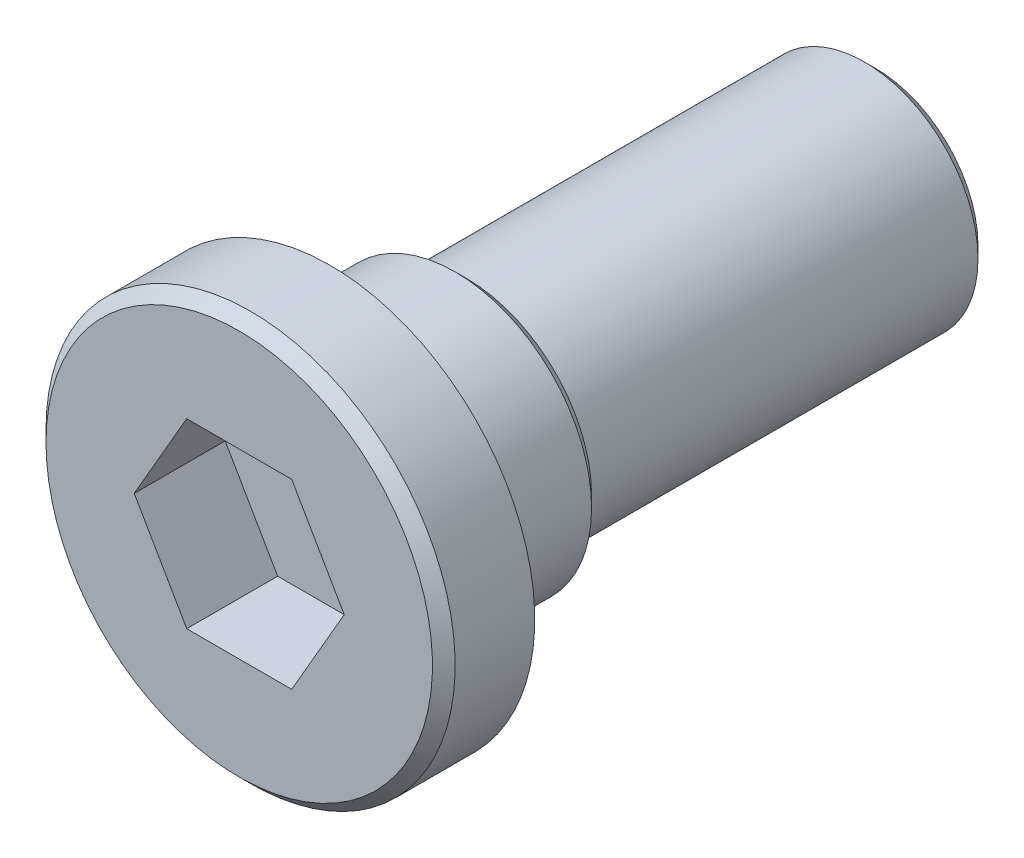
ISO-10303-21;
HEADER;
FILE_DESCRIPTION(('STEP AP214'),'2;1');
FILE_NAME('part.step','',(''),(''),'','','');
FILE_SCHEMA(('AUTOMOTIVE_DESIGN { 1 0 10303 214 1 1 1 1 }'));
ENDSEC;
DATA;
#1=APPLICATION_CONTEXT('core data for automotive mechanical design processes');
#2=APPLICATION_PROTOCOL_DEFINITION('international standard','automotive_design',2000,#1);
#3=PRODUCT_CONTEXT('',#1,'mechanical');
#4=PRODUCT('Part','Part','',(#3));
#5=PRODUCT_RELATED_PRODUCT_CATEGORY('part','',(#4));
#6=PRODUCT_DEFINITION_FORMATION('','',#4);
#7=PRODUCT_DEFINITION_CONTEXT('part definition',#1,'design');
#8=PRODUCT_DEFINITION('design','',#6,#7);
#9=PRODUCT_DEFINITION_SHAPE('','',#8);
#10=(LENGTH_UNIT() NAMED_UNIT(*) SI_UNIT(.MILLI.,.METRE.));
#11=(NAMED_UNIT(*) PLANE_ANGLE_UNIT() SI_UNIT($,.RADIAN.));
#12=(NAMED_UNIT(*) SI_UNIT($,.STERADIAN.) SOLID_ANGLE_UNIT());
#13=UNCERTAINTY_MEASURE_WITH_UNIT(LENGTH_MEASURE(1.E-05),#10,'distance_accuracy_value','');
#14=(GEOMETRIC_REPRESENTATION_CONTEXT(3) GLOBAL_UNCERTAINTY_ASSIGNED_CONTEXT((#13)) GLOBAL_UNIT_ASSIGNED_CONTEXT((#10,
#11,#12)) REPRESENTATION_CONTEXT('',''));
#15=CARTESIAN_POINT('',(0.,0.,0.));
#16=DIRECTION('',(0.,0.,1.));
#17=DIRECTION('',(1.,0.,0.));
#18=AXIS2_PLACEMENT_3D('',#15,#16,#17);
#19=CARTESIAN_POINT('',(2.25,0.,0.));
#20=DIRECTION('',(0.,0.,-1.));
#21=DIRECTION('',(-1.,0.,0.));
#22=AXIS2_PLACEMENT_3D('',#19,#20,#21);
#23=PLANE('',#22);
#24=CARTESIAN_POINT('',(0.,0.,0.));
#25=DIRECTION('',(0.,0.,-1.));
#26=DIRECTION('',(-1.,0.,0.));
#27=AXIS2_PLACEMENT_3D('',#24,#25,#26);
#28=CIRCLE('',#27,2.125);
#29=CARTESIAN_POINT('',(-2.125,0.,0.));
#30=VERTEX_POINT('',#29);
#31=EDGE_CURVE('E11',#30,#30,#28,.F.);
#32=ORIENTED_EDGE('',*,*,#31,.T.);
#33=EDGE_LOOP('',(#32));
#34=FACE_BOUND('',#33,.T.);
#35=DIRECTION('',(-0.5,0.866025403784438,0.));
#36=VECTOR('',#35,1.);
#37=CARTESIAN_POINT('',(1.15470053837925,0.,0.));
#38=LINE('',#37,#36);
#39=CARTESIAN_POINT('',(1.15470053837925,0.,0.));
#40=VERTEX_POINT('',#39);
#41=CARTESIAN_POINT('',(0.577350269189625,1.,0.));
#42=VERTEX_POINT('',#41);
#43=EDGE_CURVE('E124',#40,#42,#38,.T.);
#44=ORIENTED_EDGE('',*,*,#43,.F.);
#45=DIRECTION('',(0.5,0.866025403784438,0.));
#46=VECTOR('',#45,1.);
#47=CARTESIAN_POINT('',(0.577350269189626,-1.,0.));
#48=LINE('',#47,#46);
#49=CARTESIAN_POINT('',(0.577350269189626,-1.,0.));
#50=VERTEX_POINT('',#49);
#51=EDGE_CURVE('E50',#50,#40,#48,.T.);
#52=ORIENTED_EDGE('',*,*,#51,.F.);
#53=DIRECTION('',(1.,0.,0.));
#54=VECTOR('',#53,1.);
#55=CARTESIAN_POINT('',(-0.577350269189626,-1.,0.));
#56=LINE('',#55,#54);
#57=CARTESIAN_POINT('',(-0.577350269189626,-1.,0.));
#58=VERTEX_POINT('',#57);
#59=EDGE_CURVE('E133',#58,#50,#56,.T.);
#60=ORIENTED_EDGE('',*,*,#59,.F.);
#61=DIRECTION('',(0.5,-0.866025403784438,0.));
#62=VECTOR('',#61,1.);
#63=CARTESIAN_POINT('',(-1.15470053837925,0.,0.));
#64=LINE('',#63,#62);
#65=CARTESIAN_POINT('',(-1.15470053837925,0.,0.));
#66=VERTEX_POINT('',#65);
#67=EDGE_CURVE('E131',#66,#58,#64,.T.);
#68=ORIENTED_EDGE('',*,*,#67,.F.);
#69=DIRECTION('',(-0.5,-0.866025403784439,0.));
#70=VECTOR('',#69,1.);
#71=CARTESIAN_POINT('',(-0.577350269189626,1.,0.));
#72=LINE('',#71,#70);
#73=CARTESIAN_POINT('',(-0.577350269189626,1.,0.));
#74=VERTEX_POINT('',#73);
#75=EDGE_CURVE('E98',#74,#66,#72,.T.);
#76=ORIENTED_EDGE('',*,*,#75,.F.);
#77=DIRECTION('',(-1.,0.,0.));
#78=VECTOR('',#77,1.);
#79=CARTESIAN_POINT('',(0.577350269189625,1.,0.));
#80=LINE('',#79,#78);
#81=EDGE_CURVE('E127',#42,#74,#80,.T.);
#82=ORIENTED_EDGE('',*,*,#81,.F.);
#83=EDGE_LOOP('',(#44,#52,#60,#68,#76,#82));
#84=FACE_BOUND('',#83,.T.);
#85=ADVANCED_FACE('F35',(#34,#84),#23,.F.);
#86=CARTESIAN_POINT('',(0.,0.,-7.));
#87=DIRECTION('',(0.,0.,1.));
#88=DIRECTION('',(1.,0.,0.));
#89=AXIS2_PLACEMENT_3D('',#86,#87,#88);
#90=PLANE('',#89);
#91=CARTESIAN_POINT('',(0.,0.,-7.));
#92=DIRECTION('',(0.,0.,1.));
#93=DIRECTION('',(1.,0.,0.));
#94=AXIS2_PLACEMENT_3D('',#91,#92,#93);
#95=CIRCLE('',#94,1.125);
#96=CARTESIAN_POINT('',(1.125,0.,-7.));
#97=VERTEX_POINT('',#96);
#98=EDGE_CURVE('E157',#97,#97,#95,.F.);
#99=ORIENTED_EDGE('',*,*,#98,.T.);
#100=EDGE_LOOP('',(#99));
#101=FACE_BOUND('',#100,.T.);
#102=ADVANCED_FACE('F178',(#101),#90,.F.);
#103=CARTESIAN_POINT('',(0.,0.,0.));
#104=DIRECTION('',(0.,0.,-1.));
#105=DIRECTION('',(-1.,0.,0.));
#106=AXIS2_PLACEMENT_3D('',#103,#104,#105);
#107=CYLINDRICAL_SURFACE('',#106,1.25);
#108=CARTESIAN_POINT('',(0.,0.,-6.875));
#109=DIRECTION('',(0.,0.,1.));
#110=DIRECTION('',(1.,0.,0.));
#111=AXIS2_PLACEMENT_3D('',#108,#109,#110);
#112=CIRCLE('',#111,1.25);
#113=CARTESIAN_POINT('',(1.25,0.,-6.875));
#114=VERTEX_POINT('',#113);
#115=EDGE_CURVE('E160',#114,#114,#112,.T.);
#116=ORIENTED_EDGE('',*,*,#115,.T.);
#117=EDGE_LOOP('',(#116));
#118=FACE_BOUND('',#117,.T.);
#119=CARTESIAN_POINT('',(0.,0.,-2.5));
#120=DIRECTION('',(0.,0.,-1.));
#121=DIRECTION('',(-1.,0.,0.));
#122=AXIS2_PLACEMENT_3D('',#119,#120,#121);
#123=CIRCLE('',#122,1.25);
#124=CARTESIAN_POINT('',(-1.25,0.,-2.5));
#125=VERTEX_POINT('',#124);
#126=EDGE_CURVE('E148',#125,#125,#123,.T.);
#127=ORIENTED_EDGE('',*,*,#126,.T.);
#128=EDGE_LOOP('',(#127));
#129=FACE_BOUND('',#128,.T.);
#130=ADVANCED_FACE('F184',(#118,#129),#107,.T.);
#131=CARTESIAN_POINT('',(1.25,0.,-2.5));
#132=DIRECTION('',(0.,0.,1.));
#133=DIRECTION('',(1.,0.,0.));
#134=AXIS2_PLACEMENT_3D('',#131,#132,#133);
#135=PLANE('',#134);
#136=CARTESIAN_POINT('',(0.,0.,-2.5));
#137=DIRECTION('',(0.,0.,1.));
#138=DIRECTION('',(1.,0.,0.));
#139=AXIS2_PLACEMENT_3D('',#136,#137,#138);
#140=CIRCLE('',#139,1.375);
#141=CARTESIAN_POINT('',(1.375,0.,-2.5));
#142=VERTEX_POINT('',#141);
#143=EDGE_CURVE('E151',#142,#142,#140,.F.);
#144=ORIENTED_EDGE('',*,*,#143,.T.);
#145=EDGE_LOOP('',(#144));
#146=FACE_BOUND('',#145,.T.);
#147=ORIENTED_EDGE('',*,*,#126,.F.);
#148=EDGE_LOOP('',(#147));
#149=FACE_BOUND('',#148,.T.);
#150=ADVANCED_FACE('F201',(#146,#149),#135,.F.);
#151=CARTESIAN_POINT('',(0.,0.,0.));
#152=DIRECTION('',(0.,0.,-1.));
#153=DIRECTION('',(-1.,0.,0.));
#154=AXIS2_PLACEMENT_3D('',#151,#152,#153);
#155=CYLINDRICAL_SURFACE('',#154,1.5);
#156=CARTESIAN_POINT('',(0.,0.,-2.375));
#157=DIRECTION('',(0.,0.,1.));
#158=DIRECTION('',(1.,0.,0.));
#159=AXIS2_PLACEMENT_3D('',#156,#157,#158);
#160=CIRCLE('',#159,1.5);
#161=CARTESIAN_POINT('',(1.5,0.,-2.375));
#162=VERTEX_POINT('',#161);
#163=EDGE_CURVE('E154',#162,#162,#160,.T.);
#164=ORIENTED_EDGE('',*,*,#163,.T.);
#165=EDGE_LOOP('',(#164));
#166=FACE_BOUND('',#165,.T.);
#167=CARTESIAN_POINT('',(0.,0.,-1.));
#168=DIRECTION('',(0.,0.,-1.));
#169=DIRECTION('',(-1.,0.,0.));
#170=AXIS2_PLACEMENT_3D('',#167,#168,#169);
#171=CIRCLE('',#170,1.5);
#172=CARTESIAN_POINT('',(-1.5,0.,-1.));
#173=VERTEX_POINT('',#172);
#174=EDGE_CURVE('E145',#173,#173,#171,.T.);
#175=ORIENTED_EDGE('',*,*,#174,.T.);
#176=EDGE_LOOP('',(#175));
#177=FACE_BOUND('',#176,.T.);
#178=ADVANCED_FACE('F204',(#166,#177),#155,.T.);
#179=CARTESIAN_POINT('',(1.5,0.,-1.));
#180=DIRECTION('',(0.,0.,1.));
#181=DIRECTION('',(1.,0.,0.));
#182=AXIS2_PLACEMENT_3D('',#179,#180,#181);
#183=PLANE('',#182);
#184=ORIENTED_EDGE('',*,*,#174,.F.);
#185=EDGE_LOOP('',(#184));
#186=FACE_BOUND('',#185,.T.);
#187=CARTESIAN_POINT('',(0.,0.,-1.));
#188=DIRECTION('',(0.,0.,-1.));
#189=DIRECTION('',(-1.,0.,0.));
#190=AXIS2_PLACEMENT_3D('',#187,#188,#189);
#191=CIRCLE('',#190,2.25);
#192=CARTESIAN_POINT('',(-2.25,0.,-1.));
#193=VERTEX_POINT('',#192);
#194=EDGE_CURVE('E137',#193,#193,#191,.T.);
#195=ORIENTED_EDGE('',*,*,#194,.T.);
#196=EDGE_LOOP('',(#195));
#197=FACE_BOUND('',#196,.T.);
#198=ADVANCED_FACE('F215',(#186,#197),#183,.F.);
#199=CARTESIAN_POINT('',(0.,0.,0.));
#200=DIRECTION('',(0.,0.,-1.));
#201=DIRECTION('',(-1.,0.,0.));
#202=AXIS2_PLACEMENT_3D('',#199,#200,#201);
#203=CYLINDRICAL_SURFACE('',#202,2.25);
#204=CARTESIAN_POINT('',(0.,0.,-0.124999999999999));
#205=DIRECTION('',(0.,0.,-1.));
#206=DIRECTION('',(-1.,0.,0.));
#207=AXIS2_PLACEMENT_3D('',#204,#205,#206);
#208=CIRCLE('',#207,2.25);
#209=CARTESIAN_POINT('',(-2.25,0.,-0.124999999999999));
#210=VERTEX_POINT('',#209);
#211=EDGE_CURVE('E43',#210,#210,#208,.T.);
#212=ORIENTED_EDGE('',*,*,#211,.T.);
#213=EDGE_LOOP('',(#212));
#214=FACE_BOUND('',#213,.T.);
#215=ORIENTED_EDGE('',*,*,#194,.F.);
#216=EDGE_LOOP('',(#215));
#217=FACE_BOUND('',#216,.T.);
#218=ADVANCED_FACE('F165',(#214,#217),#203,.T.);
#219=CARTESIAN_POINT('',(0.577350269189626,-1.,-1.));
#220=DIRECTION('',(0.866025403784439,-0.5,0.));
#221=DIRECTION('',(0.5,0.866025403784438,0.));
#222=AXIS2_PLACEMENT_3D('',#219,#220,#221);
#223=PLANE('',#222);
#224=ORIENTED_EDGE('',*,*,#51,.T.);
#225=DIRECTION('',(0.,0.,1.));
#226=VECTOR('',#225,1.);
#227=CARTESIAN_POINT('',(1.15470053837925,0.,-1.));
#228=LINE('',#227,#226);
#229=CARTESIAN_POINT('',(1.15470053837925,0.,-1.));
#230=VERTEX_POINT('',#229);
#231=EDGE_CURVE('E80',#230,#40,#228,.T.);
#232=ORIENTED_EDGE('',*,*,#231,.F.);
#233=DIRECTION('',(0.5,0.866025403784438,0.));
#234=VECTOR('',#233,1.);
#235=CARTESIAN_POINT('',(0.577350269189626,-1.,-1.));
#236=LINE('',#235,#234);
#237=CARTESIAN_POINT('',(0.577350269189626,-1.,-1.));
#238=VERTEX_POINT('',#237);
#239=EDGE_CURVE('E135',#238,#230,#236,.T.);
#240=ORIENTED_EDGE('',*,*,#239,.F.);
#241=DIRECTION('',(0.,0.,1.));
#242=VECTOR('',#241,1.);
#243=CARTESIAN_POINT('',(0.577350269189626,-1.,-1.));
#244=LINE('',#243,#242);
#245=EDGE_CURVE('E58',#238,#50,#244,.T.);
#246=ORIENTED_EDGE('',*,*,#245,.T.);
#247=EDGE_LOOP('',(#224,#232,#240,#246));
#248=FACE_BOUND('',#247,.T.);
#249=ADVANCED_FACE('F222',(#248),#223,.F.);
#250=CARTESIAN_POINT('',(-0.577350269189626,-1.,-1.));
#251=DIRECTION('',(0.,-1.,0.));
#252=DIRECTION('',(0.,0.,-1.));
#253=AXIS2_PLACEMENT_3D('',#250,#251,#252);
#254=PLANE('',#253);
#255=ORIENTED_EDGE('',*,*,#59,.T.);
#256=ORIENTED_EDGE('',*,*,#245,.F.);
#257=DIRECTION('',(1.,0.,0.));
#258=VECTOR('',#257,1.);
#259=CARTESIAN_POINT('',(-0.577350269189626,-1.,-1.));
#260=LINE('',#259,#258);
#261=CARTESIAN_POINT('',(-0.577350269189626,-1.,-1.));
#262=VERTEX_POINT('',#261);
#263=EDGE_CURVE('E110',#262,#238,#260,.T.);
#264=ORIENTED_EDGE('',*,*,#263,.F.);
#265=DIRECTION('',(0.,0.,1.));
#266=VECTOR('',#265,1.);
#267=CARTESIAN_POINT('',(-0.577350269189626,-1.,-1.));
#268=LINE('',#267,#266);
#269=EDGE_CURVE('E102',#262,#58,#268,.T.);
#270=ORIENTED_EDGE('',*,*,#269,.T.);
#271=EDGE_LOOP('',(#255,#256,#264,#270));
#272=FACE_BOUND('',#271,.T.);
#273=ADVANCED_FACE('F225',(#272),#254,.F.);
#274=CARTESIAN_POINT('',(-1.15470053837925,0.,-1.));
#275=DIRECTION('',(-0.866025403784438,-0.5,0.));
#276=DIRECTION('',(0.5,-0.866025403784439,0.));
#277=AXIS2_PLACEMENT_3D('',#274,#275,#276);
#278=PLANE('',#277);
#279=ORIENTED_EDGE('',*,*,#67,.T.);
#280=ORIENTED_EDGE('',*,*,#269,.F.);
#281=DIRECTION('',(0.5,-0.866025403784438,0.));
#282=VECTOR('',#281,1.);
#283=CARTESIAN_POINT('',(-1.15470053837925,0.,-1.));
#284=LINE('',#283,#282);
#285=CARTESIAN_POINT('',(-1.15470053837925,0.,-1.));
#286=VERTEX_POINT('',#285);
#287=EDGE_CURVE('E106',#286,#262,#284,.T.);
#288=ORIENTED_EDGE('',*,*,#287,.F.);
#289=DIRECTION('',(0.,0.,1.));
#290=VECTOR('',#289,1.);
#291=CARTESIAN_POINT('',(-1.15470053837925,0.,-1.));
#292=LINE('',#291,#290);
#293=EDGE_CURVE('E91',#286,#66,#292,.T.);
#294=ORIENTED_EDGE('',*,*,#293,.T.);
#295=EDGE_LOOP('',(#279,#280,#288,#294));
#296=FACE_BOUND('',#295,.T.);
#297=ADVANCED_FACE('F107',(#296),#278,.F.);
#298=CARTESIAN_POINT('',(-0.577350269189626,1.,-1.));
#299=DIRECTION('',(-0.866025403784439,0.5,0.));
#300=DIRECTION('',(-0.5,-0.866025403784439,0.));
#301=AXIS2_PLACEMENT_3D('',#298,#299,#300);
#302=PLANE('',#301);
#303=ORIENTED_EDGE('',*,*,#75,.T.);
#304=ORIENTED_EDGE('',*,*,#293,.F.);
#305=DIRECTION('',(-0.5,-0.866025403784439,0.));
#306=VECTOR('',#305,1.);
#307=CARTESIAN_POINT('',(-0.577350269189626,1.,-1.));
#308=LINE('',#307,#306);
#309=CARTESIAN_POINT('',(-0.577350269189626,1.,-1.));
#310=VERTEX_POINT('',#309);
#311=EDGE_CURVE('E95',#310,#286,#308,.T.);
#312=ORIENTED_EDGE('',*,*,#311,.F.);
#313=DIRECTION('',(0.,0.,1.));
#314=VECTOR('',#313,1.);
#315=CARTESIAN_POINT('',(-0.577350269189626,1.,-1.));
#316=LINE('',#315,#314);
#317=EDGE_CURVE('E103',#310,#74,#316,.T.);
#318=ORIENTED_EDGE('',*,*,#317,.T.);
#319=EDGE_LOOP('',(#303,#304,#312,#318));
#320=FACE_BOUND('',#319,.T.);
#321=ADVANCED_FACE('F93',(#320),#302,.F.);
#322=CARTESIAN_POINT('',(0.577350269189625,1.,-1.));
#323=DIRECTION('',(0.,1.,0.));
#324=DIRECTION('',(0.,0.,1.));
#325=AXIS2_PLACEMENT_3D('',#322,#323,#324);
#326=PLANE('',#325);
#327=ORIENTED_EDGE('',*,*,#81,.T.);
#328=ORIENTED_EDGE('',*,*,#317,.F.);
#329=DIRECTION('',(-1.,0.,0.));
#330=VECTOR('',#329,1.);
#331=CARTESIAN_POINT('',(0.577350269189625,1.,-1.));
#332=LINE('',#331,#330);
#333=CARTESIAN_POINT('',(0.577350269189625,1.,-1.));
#334=VERTEX_POINT('',#333);
#335=EDGE_CURVE('E116',#334,#310,#332,.T.);
#336=ORIENTED_EDGE('',*,*,#335,.F.);
#337=DIRECTION('',(0.,0.,1.));
#338=VECTOR('',#337,1.);
#339=CARTESIAN_POINT('',(0.577350269189625,1.,-1.));
#340=LINE('',#339,#338);
#341=EDGE_CURVE('E140',#334,#42,#340,.T.);
#342=ORIENTED_EDGE('',*,*,#341,.T.);
#343=EDGE_LOOP('',(#327,#328,#336,#342));
#344=FACE_BOUND('',#343,.T.);
#345=ADVANCED_FACE('F228',(#344),#326,.F.);
#346=CARTESIAN_POINT('',(1.15470053837925,0.,-1.));
#347=DIRECTION('',(0.866025403784438,0.5,0.));
#348=DIRECTION('',(-0.5,0.866025403784438,0.));
#349=AXIS2_PLACEMENT_3D('',#346,#347,#348);
#350=PLANE('',#349);
#351=ORIENTED_EDGE('',*,*,#43,.T.);
#352=ORIENTED_EDGE('',*,*,#341,.F.);
#353=DIRECTION('',(-0.5,0.866025403784438,0.));
#354=VECTOR('',#353,1.);
#355=CARTESIAN_POINT('',(1.15470053837925,0.,-1.));
#356=LINE('',#355,#354);
#357=EDGE_CURVE('E118',#230,#334,#356,.T.);
#358=ORIENTED_EDGE('',*,*,#357,.F.);
#359=ORIENTED_EDGE('',*,*,#231,.T.);
#360=EDGE_LOOP('',(#351,#352,#358,#359));
#361=FACE_BOUND('',#360,.T.);
#362=ADVANCED_FACE('F195',(#361),#350,.F.);
#363=CARTESIAN_POINT('',(0.,0.,-1.));
#364=DIRECTION('',(0.,0.,1.));
#365=DIRECTION('',(1.,0.,0.));
#366=AXIS2_PLACEMENT_3D('',#363,#364,#365);
#367=PLANE('',#366);
#368=ORIENTED_EDGE('',*,*,#239,.T.);
#369=ORIENTED_EDGE('',*,*,#357,.T.);
#370=ORIENTED_EDGE('',*,*,#335,.T.);
#371=ORIENTED_EDGE('',*,*,#311,.T.);
#372=ORIENTED_EDGE('',*,*,#287,.T.);
#373=ORIENTED_EDGE('',*,*,#263,.T.);
#374=EDGE_LOOP('',(#368,#369,#370,#371,#372,#373));
#375=FACE_BOUND('',#374,.T.);
#376=ADVANCED_FACE('F113',(#375),#367,.T.);
#377=CARTESIAN_POINT('',(0.,0.,-2.5));
#378=DIRECTION('',(0.,0.,1.));
#379=DIRECTION('',(1.,0.,0.));
#380=AXIS2_PLACEMENT_3D('',#377,#378,#379);
#381=CONICAL_SURFACE('',#380,1.375,0.785398163397445);
#382=ORIENTED_EDGE('',*,*,#163,.F.);
#383=EDGE_LOOP('',(#382));
#384=FACE_BOUND('',#383,.T.);
#385=ORIENTED_EDGE('',*,*,#143,.F.);
#386=EDGE_LOOP('',(#385));
#387=FACE_BOUND('',#386,.T.);
#388=ADVANCED_FACE('F174',(#384,#387),#381,.T.);
#389=CARTESIAN_POINT('',(0.,0.,-7.));
#390=DIRECTION('',(0.,0.,1.));
#391=DIRECTION('',(1.,0.,0.));
#392=AXIS2_PLACEMENT_3D('',#389,#390,#391);
#393=CONICAL_SURFACE('',#392,1.125,0.785398163397452);
#394=ORIENTED_EDGE('',*,*,#115,.F.);
#395=EDGE_LOOP('',(#394));
#396=FACE_BOUND('',#395,.T.);
#397=ORIENTED_EDGE('',*,*,#98,.F.);
#398=EDGE_LOOP('',(#397));
#399=FACE_BOUND('',#398,.T.);
#400=ADVANCED_FACE('F169',(#396,#399),#393,.T.);
#401=CARTESIAN_POINT('',(0.,0.,-0.124999999999999));
#402=DIRECTION('',(0.,0.,-1.));
#403=DIRECTION('',(-1.,0.,0.));
#404=AXIS2_PLACEMENT_3D('',#401,#402,#403);
#405=CONICAL_SURFACE('',#404,2.25,0.78539816339745);
#406=ORIENTED_EDGE('',*,*,#31,.F.);
#407=EDGE_LOOP('',(#406));
#408=FACE_BOUND('',#407,.T.);
#409=ORIENTED_EDGE('',*,*,#211,.F.);
#410=EDGE_LOOP('',(#409));
#411=FACE_BOUND('',#410,.T.);
#412=ADVANCED_FACE('F37',(#408,#411),#405,.T.);
#413=CLOSED_SHELL('',(#85,#102,#130,#150,#178,#198,#218,#249,#273,#297,#321,#345,#362,#376,#388,
#400,#412));
#414=MANIFOLD_SOLID_BREP('B2',#413);
#415=ADVANCED_BREP_SHAPE_REPRESENTATION('',(#18,#414),#14);
#416=SHAPE_DEFINITION_REPRESENTATION(#9,#415);
ENDSEC;
END-ISO-10303-21;
